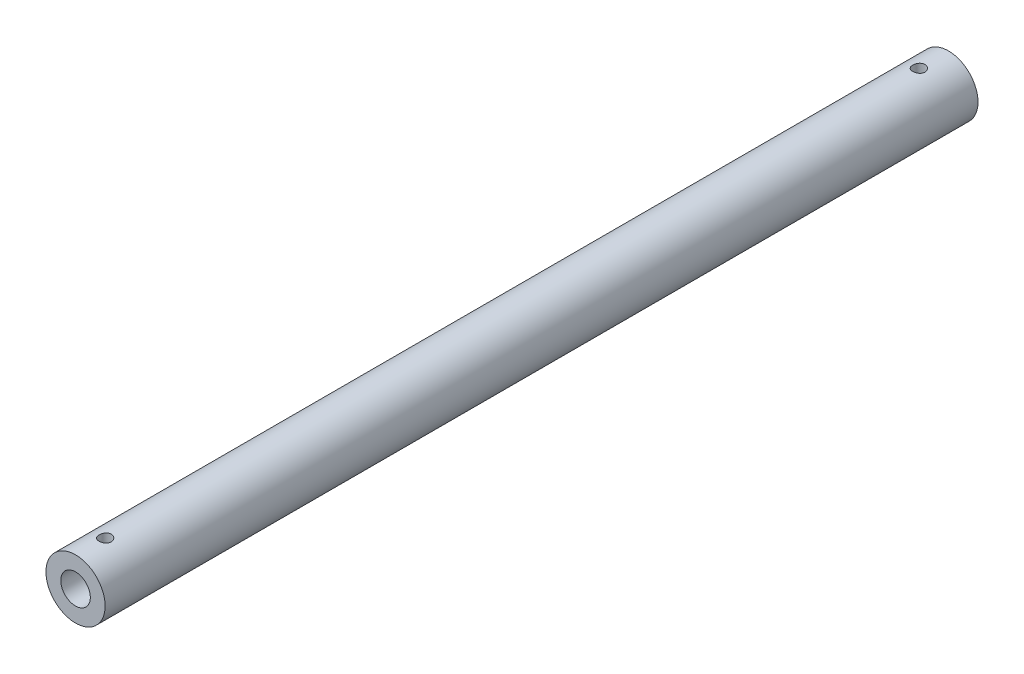
ISO-10303-21;
HEADER;
FILE_DESCRIPTION(('STEP AP214'),'2;1');
FILE_NAME('part.step','',(''),(''),'','','');
FILE_SCHEMA(('AUTOMOTIVE_DESIGN { 1 0 10303 214 1 1 1 1 }'));
ENDSEC;
DATA;
#1=APPLICATION_CONTEXT('core data for automotive mechanical design processes');
#2=APPLICATION_PROTOCOL_DEFINITION('international standard','automotive_design',2000,#1);
#3=PRODUCT_CONTEXT('',#1,'mechanical');
#4=PRODUCT('Part','Part','',(#3));
#5=PRODUCT_RELATED_PRODUCT_CATEGORY('part','',(#4));
#6=PRODUCT_DEFINITION_FORMATION('','',#4);
#7=PRODUCT_DEFINITION_CONTEXT('part definition',#1,'design');
#8=PRODUCT_DEFINITION('design','',#6,#7);
#9=PRODUCT_DEFINITION_SHAPE('','',#8);
#10=(LENGTH_UNIT() NAMED_UNIT(*) SI_UNIT(.MILLI.,.METRE.));
#11=(NAMED_UNIT(*) PLANE_ANGLE_UNIT() SI_UNIT($,.RADIAN.));
#12=(NAMED_UNIT(*) SI_UNIT($,.STERADIAN.) SOLID_ANGLE_UNIT());
#13=UNCERTAINTY_MEASURE_WITH_UNIT(LENGTH_MEASURE(1.E-05),#10,'distance_accuracy_value','');
#14=(GEOMETRIC_REPRESENTATION_CONTEXT(3) GLOBAL_UNCERTAINTY_ASSIGNED_CONTEXT((#13)) GLOBAL_UNIT_ASSIGNED_CONTEXT((#10,
#11,#12)) REPRESENTATION_CONTEXT('',''));
#15=CARTESIAN_POINT('',(0.,0.,0.));
#16=DIRECTION('',(0.,0.,1.));
#17=DIRECTION('',(1.,0.,0.));
#18=AXIS2_PLACEMENT_3D('',#15,#16,#17);
#19=CARTESIAN_POINT('',(0.,0.,-221.25));
#20=DIRECTION('',(0.,0.,1.));
#21=DIRECTION('',(1.,0.,0.));
#22=AXIS2_PLACEMENT_3D('',#19,#20,#21);
#23=CYLINDRICAL_SURFACE('',#22,15.);
#24=CARTESIAN_POINT('',(0.,15.,203.15));
#25=CARTESIAN_POINT('',(-0.172165692568075,14.9999968145247,203.15000618457));
#26=CARTESIAN_POINT('',(-0.344408344623985,14.997005579049,203.164390881014));
#27=CARTESIAN_POINT('',(-0.6840167687517,14.9853616038391,203.221499057615));
#28=CARTESIAN_POINT('',(-0.851378698493532,14.9767045230125,203.264244267549));
#29=CARTESIAN_POINT('',(-1.17626714760312,14.9546945810427,203.376689905818));
#30=CARTESIAN_POINT('',(-1.33380320695701,14.9413463608244,203.446363700585));
#31=CARTESIAN_POINT('',(-1.63494054093473,14.9114015957254,203.610607679373));
#32=CARTESIAN_POINT('',(-1.77854248092075,14.8948052060611,203.705176673833));
#33=CARTESIAN_POINT('',(-2.0498140026125,14.8599203077403,203.917970705814));
#34=CARTESIAN_POINT('',(-2.17725387792713,14.841612714398,204.03648547387));
#35=CARTESIAN_POINT('',(-2.41059374938868,14.8055061029318,204.293184305505));
#36=CARTESIAN_POINT('',(-2.51649198363873,14.7877071265103,204.431369976402));
#37=CARTESIAN_POINT('',(-2.70473262746811,14.7544460628154,204.725156332992));
#38=CARTESIAN_POINT('',(-2.78683486689837,14.7390084976833,204.880913928046));
#39=CARTESIAN_POINT('',(-2.92361365563604,14.7124902368737,205.204385744111));
#40=CARTESIAN_POINT('',(-2.97829310959917,14.7014090797868,205.372098696646));
#41=CARTESIAN_POINT('',(-3.05792378241659,14.6850518417562,205.712241853876));
#42=CARTESIAN_POINT('',(-3.08327931876006,14.6796968878264,205.884573532448));
#43=CARTESIAN_POINT('',(-3.1047987188951,14.6751611480918,206.231121638894));
#44=CARTESIAN_POINT('',(-3.10096577486346,14.6759796871273,206.405337858587));
#45=CARTESIAN_POINT('',(-3.06454338331474,14.6836268744082,206.747735233949));
#46=CARTESIAN_POINT('',(-3.03241955530402,14.6903582036209,206.915968419241));
#47=CARTESIAN_POINT('',(-2.94106317686199,14.7089190681247,207.244604990454));
#48=CARTESIAN_POINT('',(-2.88182925294598,14.7207488617187,207.405007979217));
#49=CARTESIAN_POINT('',(-2.73749545783407,14.7482719850807,207.714761349049));
#50=CARTESIAN_POINT('',(-2.65221295005861,14.7639924411575,207.864024117796));
#51=CARTESIAN_POINT('',(-2.45833155039526,14.7975084496401,208.146294231118));
#52=CARTESIAN_POINT('',(-2.34972980522963,14.8153042558583,208.279299583353));
#53=CARTESIAN_POINT('',(-2.10980951412047,14.8513860400371,208.527964018986));
#54=CARTESIAN_POINT('',(-1.97809406671112,14.8696748609556,208.643240085605));
#55=CARTESIAN_POINT('',(-1.69699917981561,14.9043690302707,208.850124474423));
#56=CARTESIAN_POINT('',(-1.54761948341342,14.920774351266,208.94173245232));
#57=CARTESIAN_POINT('',(-1.23499644988396,14.949897695655,209.098759280562));
#58=CARTESIAN_POINT('',(-1.07172936615429,14.9626092321176,209.164132133225));
#59=CARTESIAN_POINT('',(-0.736208050305234,14.9828639201261,209.266412723749));
#60=CARTESIAN_POINT('',(-0.56395498520553,14.9904077410196,209.30332414815));
#61=CARTESIAN_POINT('',(-0.21864065072356,14.9993830838028,209.347086713271));
#62=CARTESIAN_POINT('',(-0.0456484522187994,15.0009211054796,209.354461679909));
#63=CARTESIAN_POINT('',(0.299096179156922,14.9980082795858,209.340355851714));
#64=CARTESIAN_POINT('',(0.470848686046561,14.9935577925971,209.318876794247));
#65=CARTESIAN_POINT('',(0.806532778422362,14.9792348501822,209.248107567809));
#66=CARTESIAN_POINT('',(0.970523916752335,14.9694152228943,209.199088246188));
#67=CARTESIAN_POINT('',(1.28795822388415,14.9454516233604,209.074927550587));
#68=CARTESIAN_POINT('',(1.44140056223108,14.9313073111298,208.999784122801));
#69=CARTESIAN_POINT('',(1.73557589191958,14.899998810058,208.824389568514));
#70=CARTESIAN_POINT('',(1.87611842957524,14.8827978643853,208.723825711686));
#71=CARTESIAN_POINT('',(2.13852141882691,14.8473663952166,208.500861250337));
#72=CARTESIAN_POINT('',(2.26037971863336,14.8291357534649,208.378458134182));
#73=CARTESIAN_POINT('',(2.48399401838078,14.7933375094228,208.112898224027));
#74=CARTESIAN_POINT('',(2.58538928856011,14.7757855941988,207.969435189048));
#75=CARTESIAN_POINT('',(2.76264557446453,14.7436744809272,207.667206821806));
#76=CARTESIAN_POINT('',(2.83850764553233,14.729115159199,207.508442122345));
#77=CARTESIAN_POINT('',(2.96206237859332,14.704766460738,207.180938691601));
#78=CARTESIAN_POINT('',(3.00990595506134,14.6949515802098,207.012258882349));
#79=CARTESIAN_POINT('',(3.07651834817521,14.681151621117,206.669028213839));
#80=CARTESIAN_POINT('',(3.09529124863372,14.6771657237085,206.494478182742));
#81=CARTESIAN_POINT('',(3.10307030783304,14.6755226409731,206.148088801353));
#82=CARTESIAN_POINT('',(3.09264711298509,14.6777441283759,205.976262590665));
#83=CARTESIAN_POINT('',(3.04359493211144,14.6879932817592,205.636870134022));
#84=CARTESIAN_POINT('',(3.00496620761724,14.6960208939033,205.469303848583));
#85=CARTESIAN_POINT('',(2.90086151532538,14.716921819634,205.143582191028));
#86=CARTESIAN_POINT('',(2.83546006555444,14.7297816752769,204.985402081932));
#87=CARTESIAN_POINT('',(2.67973384395482,14.7589049039727,204.682172077593));
#88=CARTESIAN_POINT('',(2.58940680339969,14.7751685868093,204.537123379167));
#89=CARTESIAN_POINT('',(2.38446392361929,14.809635154064,204.261441834902));
#90=CARTESIAN_POINT('',(2.26943782754736,14.8278678241242,204.131117642797));
#91=CARTESIAN_POINT('',(2.01920377162768,14.8640090653401,203.89143294543));
#92=CARTESIAN_POINT('',(1.88399117387353,14.8819175609529,203.78207727097));
#93=CARTESIAN_POINT('',(1.59538198786284,14.9156320795551,203.586259613768));
#94=CARTESIAN_POINT('',(1.44179699181802,14.931412025711,203.500070618688));
#95=CARTESIAN_POINT('',(1.1220352287178,14.9588332815734,203.354863888172));
#96=CARTESIAN_POINT('',(0.955869690892328,14.9704782304995,203.295822246729));
#97=CARTESIAN_POINT('',(0.657833295489253,14.9861185683186,203.21770728621));
#98=CARTESIAN_POINT('',(0.527631279793751,14.9912930325766,203.192363403325));
#99=CARTESIAN_POINT('',(0.264967984387544,14.9982349131395,203.158507682225));
#100=CARTESIAN_POINT('',(0.132506785912507,15.0000024516911,203.149995240065));
#101=CARTESIAN_POINT('',(0.,15.,203.15));
#102=B_SPLINE_CURVE_WITH_KNOTS('',3,(#24,#25,#26,#27,#28,#29,#30,#31,#32,#33,#34,#35,#36,#37,
#38,#39,#40,#41,#42,#43,#44,#45,#46,#47,#48,#49,#50,#51,#52,#53,#54,#55,#56,#57,#58,#59,#60,#61,
#62,#63,#64,#65,#66,#67,#68,#69,#70,#71,#72,#73,#74,#75,#76,#77,#78,#79,#80,#81,#82,#83,#84,#85,
#86,#87,#88,#89,#90,#91,#92,#93,#94,#95,#96,#97,#98,#99,#100,#101),.UNSPECIFIED.,.T.,.F.,(4,2,2,
2,2,2,2,2,2,2,2,2,2,2,2,2,2,2,2,2,2,2,2,2,2,2,2,2,2,2,2,2,2,2,2,2,2,2,4),(0.,0.516012233354276,
1.03242029170924,1.54831890115687,2.06419286401491,2.58672901286762,3.10930788292938,
3.63699074660939,4.16461770564988,4.68487960325838,5.20508460362237,5.71688465009023,
6.22871062886655,6.74421096019477,7.25977440270464,7.78525818005795,8.31074960120177,
8.83715837566196,9.36349895418801,9.88046246952418,10.3973948586867,10.9093302438091,
11.4213058850333,11.9399157526589,12.4585853017375,12.9857239359749,13.5128407797481,
14.0370916901281,14.5612689477046,15.0752728884932,15.5892720633185,16.1018502189675,
16.6144750448609,17.1363837856733,17.6584126215689,18.1863470781733,18.7138157401919,
19.1109771901377,19.5081243889402),.UNSPECIFIED.);
#103=CARTESIAN_POINT('',(0.,15.,203.15));
#104=VERTEX_POINT('',#103);
#105=EDGE_CURVE('E74',#104,#104,#102,.T.);
#106=ORIENTED_EDGE('',*,*,#105,.F.);
#107=EDGE_LOOP('',(#106));
#108=FACE_BOUND('',#107,.T.);
#109=CARTESIAN_POINT('',(0.,0.,-221.25));
#110=DIRECTION('',(0.,0.,1.));
#111=DIRECTION('',(1.,0.,0.));
#112=AXIS2_PLACEMENT_3D('',#109,#110,#111);
#113=CIRCLE('',#112,15.);
#114=CARTESIAN_POINT('',(15.,0.,-221.25));
#115=VERTEX_POINT('',#114);
#116=EDGE_CURVE('E10',#115,#115,#113,.T.);
#117=ORIENTED_EDGE('',*,*,#116,.T.);
#118=EDGE_LOOP('',(#117));
#119=FACE_BOUND('',#118,.T.);
#120=CARTESIAN_POINT('',(0.,0.,221.25));
#121=DIRECTION('',(0.,0.,1.));
#122=DIRECTION('',(1.,0.,0.));
#123=AXIS2_PLACEMENT_3D('',#120,#121,#122);
#124=CIRCLE('',#123,15.);
#125=CARTESIAN_POINT('',(15.,0.,221.25));
#126=VERTEX_POINT('',#125);
#127=EDGE_CURVE('E63',#126,#126,#124,.T.);
#128=ORIENTED_EDGE('',*,*,#127,.F.);
#129=EDGE_LOOP('',(#128));
#130=FACE_BOUND('',#129,.T.);
#131=CARTESIAN_POINT('',(0.,15.,-209.35));
#132=CARTESIAN_POINT('',(0.172165692568075,14.9999968145247,-209.34999381543));
#133=CARTESIAN_POINT('',(0.344408344623985,14.997005579049,-209.335609118986));
#134=CARTESIAN_POINT('',(0.6840167687517,14.9853616038391,-209.278500942385));
#135=CARTESIAN_POINT('',(0.851378698493531,14.9767045230125,-209.235755732451));
#136=CARTESIAN_POINT('',(1.17626714760312,14.9546945810427,-209.123310094182));
#137=CARTESIAN_POINT('',(1.33380320695702,14.9413463608244,-209.053636299415));
#138=CARTESIAN_POINT('',(1.63494054093474,14.9114015957254,-208.889392320627));
#139=CARTESIAN_POINT('',(1.77854248092075,14.8948052060611,-208.794823326167));
#140=CARTESIAN_POINT('',(2.0498140026125,14.8599203077403,-208.582029294186));
#141=CARTESIAN_POINT('',(2.17725387792713,14.841612714398,-208.46351452613));
#142=CARTESIAN_POINT('',(2.41059374938868,14.8055061029318,-208.206815694495));
#143=CARTESIAN_POINT('',(2.51649198363873,14.7877071265103,-208.068630023598));
#144=CARTESIAN_POINT('',(2.70473262746811,14.7544460628154,-207.774843667008));
#145=CARTESIAN_POINT('',(2.78683486689837,14.7390084976833,-207.619086071954));
#146=CARTESIAN_POINT('',(2.92361365563604,14.7124902368737,-207.295614255888));
#147=CARTESIAN_POINT('',(2.97829310959917,14.7014090797868,-207.127901303354));
#148=CARTESIAN_POINT('',(3.05792378241659,14.6850518417562,-206.787758146124));
#149=CARTESIAN_POINT('',(3.08327931876006,14.6796968878264,-206.615426467552));
#150=CARTESIAN_POINT('',(3.1047987188951,14.6751611480918,-206.268878361106));
#151=CARTESIAN_POINT('',(3.10096577486346,14.6759796871273,-206.094662141413));
#152=CARTESIAN_POINT('',(3.06454338331474,14.6836268744082,-205.752264766051));
#153=CARTESIAN_POINT('',(3.03241955530402,14.6903582036209,-205.584031580759));
#154=CARTESIAN_POINT('',(2.94106317686199,14.7089190681247,-205.255395009546));
#155=CARTESIAN_POINT('',(2.88182925294598,14.7207488617187,-205.094992020783));
#156=CARTESIAN_POINT('',(2.73749545783407,14.7482719850807,-204.785238650951));
#157=CARTESIAN_POINT('',(2.65221295005861,14.7639924411575,-204.635975882204));
#158=CARTESIAN_POINT('',(2.45833155039526,14.7975084496401,-204.353705768882));
#159=CARTESIAN_POINT('',(2.34972980522963,14.8153042558583,-204.220700416647));
#160=CARTESIAN_POINT('',(2.10980951412047,14.8513860400371,-203.972035981014));
#161=CARTESIAN_POINT('',(1.97809406671112,14.8696748609556,-203.856759914395));
#162=CARTESIAN_POINT('',(1.69699917981561,14.9043690302707,-203.649875525577));
#163=CARTESIAN_POINT('',(1.54761948341342,14.920774351266,-203.55826754768));
#164=CARTESIAN_POINT('',(1.23499644988397,14.949897695655,-203.401240719438));
#165=CARTESIAN_POINT('',(1.0717293661543,14.9626092321176,-203.335867866775));
#166=CARTESIAN_POINT('',(0.736208050305236,14.9828639201261,-203.233587276251));
#167=CARTESIAN_POINT('',(0.563954985205533,14.9904077410196,-203.19667585185));
#168=CARTESIAN_POINT('',(0.218640650723562,14.9993830838028,-203.152913286729));
#169=CARTESIAN_POINT('',(0.0456484522187996,15.0009211054796,-203.145538320091));
#170=CARTESIAN_POINT('',(-0.299096179156922,14.9980082795858,-203.159644148286));
#171=CARTESIAN_POINT('',(-0.470848686046561,14.9935577925971,-203.181123205753));
#172=CARTESIAN_POINT('',(-0.806532778422365,14.9792348501822,-203.25189243219));
#173=CARTESIAN_POINT('',(-0.970523916752342,14.9694152228943,-203.300911753812));
#174=CARTESIAN_POINT('',(-1.28795822388416,14.9454516233604,-203.425072449413));
#175=CARTESIAN_POINT('',(-1.44140056223108,14.9313073111298,-203.500215877199));
#176=CARTESIAN_POINT('',(-1.73557589191957,14.899998810058,-203.675610431486));
#177=CARTESIAN_POINT('',(-1.87611842957523,14.8827978643853,-203.776174288314));
#178=CARTESIAN_POINT('',(-2.13852141882691,14.8473663952166,-203.999138749663));
#179=CARTESIAN_POINT('',(-2.26037971863335,14.8291357534649,-204.121541865818));
#180=CARTESIAN_POINT('',(-2.48399401838079,14.7933375094228,-204.387101775973));
#181=CARTESIAN_POINT('',(-2.58538928856014,14.7757855941988,-204.530564810952));
#182=CARTESIAN_POINT('',(-2.76264557446455,14.7436744809272,-204.832793178194));
#183=CARTESIAN_POINT('',(-2.83850764553234,14.7291151591989,-204.991557877655));
#184=CARTESIAN_POINT('',(-2.96206237859332,14.704766460738,-205.319061308399));
#185=CARTESIAN_POINT('',(-3.00990595506134,14.6949515802098,-205.48774111765));
#186=CARTESIAN_POINT('',(-3.07651834817521,14.681151621117,-205.830971786161));
#187=CARTESIAN_POINT('',(-3.09529124863372,14.6771657237085,-206.005521817258));
#188=CARTESIAN_POINT('',(-3.10307030783304,14.6755226409731,-206.351911198647));
#189=CARTESIAN_POINT('',(-3.09264711298509,14.6777441283759,-206.523737409335));
#190=CARTESIAN_POINT('',(-3.04359493211143,14.6879932817592,-206.863129865978));
#191=CARTESIAN_POINT('',(-3.00496620761724,14.6960208939033,-207.030696151417));
#192=CARTESIAN_POINT('',(-2.90086151532538,14.716921819634,-207.356417808972));
#193=CARTESIAN_POINT('',(-2.83546006555444,14.7297816752769,-207.514597918068));
#194=CARTESIAN_POINT('',(-2.67973384395482,14.7589049039727,-207.817827922407));
#195=CARTESIAN_POINT('',(-2.58940680339969,14.7751685868093,-207.962876620833));
#196=CARTESIAN_POINT('',(-2.38446392361929,14.809635154064,-208.238558165098));
#197=CARTESIAN_POINT('',(-2.26943782754736,14.8278678241242,-208.368882357203));
#198=CARTESIAN_POINT('',(-2.01920377162768,14.8640090653401,-208.60856705457));
#199=CARTESIAN_POINT('',(-1.88399117387353,14.8819175609529,-208.71792272903));
#200=CARTESIAN_POINT('',(-1.59538198786284,14.9156320795551,-208.913740386232));
#201=CARTESIAN_POINT('',(-1.44179699181802,14.931412025711,-208.999929381312));
#202=CARTESIAN_POINT('',(-1.1220352287178,14.9588332815734,-209.145136111828));
#203=CARTESIAN_POINT('',(-0.955869690892328,14.9704782304995,-209.204177753271));
#204=CARTESIAN_POINT('',(-0.657833295489253,14.9861185683186,-209.28229271379));
#205=CARTESIAN_POINT('',(-0.527631279793751,14.9912930325766,-209.307636596675));
#206=CARTESIAN_POINT('',(-0.264967984387544,14.9982349131395,-209.341492317775));
#207=CARTESIAN_POINT('',(-0.132506785912507,15.0000024516911,-209.350004759935));
#208=CARTESIAN_POINT('',(0.,15.,-209.35));
#209=B_SPLINE_CURVE_WITH_KNOTS('',3,(#131,#132,#133,#134,#135,#136,#137,#138,#139,#140,#141,
#142,#143,#144,#145,#146,#147,#148,#149,#150,#151,#152,#153,#154,#155,#156,#157,#158,#159,#160,
#161,#162,#163,#164,#165,#166,#167,#168,#169,#170,#171,#172,#173,#174,#175,#176,#177,#178,#179,
#180,#181,#182,#183,#184,#185,#186,#187,#188,#189,#190,#191,#192,#193,#194,#195,#196,#197,#198,
#199,#200,#201,#202,#203,#204,#205,#206,#207,#208),.UNSPECIFIED.,.T.,.F.,(4,2,2,2,2,2,2,2,2,2,2,
2,2,2,2,2,2,2,2,2,2,2,2,2,2,2,2,2,2,2,2,2,2,2,2,2,2,2,4),(0.,0.516012233354276,1.03242029170924,
1.54831890115688,2.06419286401491,2.58672901286762,3.10930788292938,3.63699074660939,
4.16461770564988,4.68487960325835,5.20508460362237,5.71688465009023,6.22871062886655,
6.74421096019477,7.25977440270464,7.78525818005795,8.31074960120177,8.83715837566194,
9.36349895418801,9.88046246952418,10.3973948586867,10.9093302438091,11.4213058850333,
11.9399157526589,12.4585853017375,12.9857239359749,13.5128407797481,14.0370916901281,
14.5612689477046,15.0752728884932,15.5892720633185,16.1018502189675,16.6144750448609,
17.1363837856733,17.6584126215689,18.1863470781733,18.7138157401919,19.1109771901377,
19.5081243889402),.UNSPECIFIED.);
#210=CARTESIAN_POINT('',(0.,15.,-209.35));
#211=VERTEX_POINT('',#210);
#212=EDGE_CURVE('E73',#211,#211,#209,.T.);
#213=ORIENTED_EDGE('',*,*,#212,.T.);
#214=EDGE_LOOP('',(#213));
#215=FACE_BOUND('',#214,.T.);
#216=ADVANCED_FACE('F43',(#108,#119,#130,#215),#23,.T.);
#217=CARTESIAN_POINT('',(0.,0.,-221.25));
#218=DIRECTION('',(0.,0.,1.));
#219=DIRECTION('',(1.,0.,0.));
#220=AXIS2_PLACEMENT_3D('',#217,#218,#219);
#221=CYLINDRICAL_SURFACE('',#220,7.5);
#222=CARTESIAN_POINT('',(0.,7.5,203.15));
#223=CARTESIAN_POINT('',(-0.166153002613096,7.49999499657015,203.150006439139));
#224=CARTESIAN_POINT('',(-0.332600464403828,7.49441556709234,203.163437102607));
#225=CARTESIAN_POINT('',(-0.660768761003523,7.47265556326767,203.216659456979));
#226=CARTESIAN_POINT('',(-0.822475981409231,7.4564470859861,203.25652053498));
#227=CARTESIAN_POINT('',(-1.13589928883872,7.41516232897275,203.360897830234));
#228=CARTESIAN_POINT('',(-1.28764700409263,7.39011591076245,203.425331081826));
#229=CARTESIAN_POINT('',(-1.57803340286612,7.33360222650622,203.57668057778));
#230=CARTESIAN_POINT('',(-1.71667615552021,7.30213696318032,203.663589811752));
#231=CARTESIAN_POINT('',(-1.98400959910197,7.23419554679821,203.86197764626));
#232=CARTESIAN_POINT('',(-2.11196525773685,7.19755699911941,203.974390668417));
#233=CARTESIAN_POINT('',(-2.34783768718456,7.12411042208018,204.218619929221));
#234=CARTESIAN_POINT('',(-2.45574406182104,7.0873023148786,204.350446171071));
#235=CARTESIAN_POINT('',(-2.6535947314415,7.01570032840253,204.637471400951));
#236=CARTESIAN_POINT('',(-2.74242148647984,6.98108925988135,204.793491095404));
#237=CARTESIAN_POINT('',(-2.89224243961144,6.9203697427042,205.119896741966));
#238=CARTESIAN_POINT('',(-2.9532507497489,6.89425698486144,205.290275357834));
#239=CARTESIAN_POINT('',(-3.04268024888774,6.8552453498953,205.632104091265));
#240=CARTESIAN_POINT('',(-3.07251470951095,6.84177651513845,205.803116939132));
#241=CARTESIAN_POINT('',(-3.10316007729673,6.82793602371857,206.148211058538));
#242=CARTESIAN_POINT('',(-3.10398662811009,6.82755730769831,206.322290625546));
#243=CARTESIAN_POINT('',(-3.07765851268915,6.83945669009682,206.654603117149));
#244=CARTESIAN_POINT('',(-3.05260360053316,6.85078502883839,206.813043193012));
#245=CARTESIAN_POINT('',(-2.97874158057689,6.88321931438638,207.123228128714));
#246=CARTESIAN_POINT('',(-2.92993000846889,6.90432709889237,207.274971724314));
#247=CARTESIAN_POINT('',(-2.80899254802325,6.95441629953129,207.57125495533));
#248=CARTESIAN_POINT('',(-2.73639615555451,6.98355455159123,207.715574835102));
#249=CARTESIAN_POINT('',(-2.57028194875633,7.04638370508448,207.990539248003));
#250=CARTESIAN_POINT('',(-2.47675595937095,7.0800763834253,208.121178408124));
#251=CARTESIAN_POINT('',(-2.26231791362187,7.15162260147758,208.37649017387));
#252=CARTESIAN_POINT('',(-2.13977666022387,7.18958932893573,208.499766523274));
#253=CARTESIAN_POINT('',(-1.87537753928262,7.26304146095989,208.72448333847));
#254=CARTESIAN_POINT('',(-1.73351530071414,7.29852630128624,208.825918849724));
#255=CARTESIAN_POINT('',(-1.43031567972321,7.3640172601883,209.006077758159));
#256=CARTESIAN_POINT('',(-1.2686134301535,7.3938829557076,209.084241913309));
#257=CARTESIAN_POINT('',(-0.932805541489826,7.44369617955768,209.211770039552));
#258=CARTESIAN_POINT('',(-0.758706702716548,7.46364909848067,209.261149666282));
#259=CARTESIAN_POINT('',(-0.414723271042768,7.49038660533013,209.326804702462));
#260=CARTESIAN_POINT('',(-0.245254188339049,7.49791555875999,209.344954434622));
#261=CARTESIAN_POINT('',(0.0944609767199231,7.50132646954416,209.353211537545));
#262=CARTESIAN_POINT('',(0.26470682703357,7.4972117034244,209.343326797167));
#263=CARTESIAN_POINT('',(0.592423142194307,7.4782813005357,209.297145000089));
#264=CARTESIAN_POINT('',(0.750112133817265,7.46399615818736,209.262156687961));
#265=CARTESIAN_POINT('',(1.05721523253206,7.42672470407196,209.168574109654));
#266=CARTESIAN_POINT('',(1.20662828750662,7.40373728888471,209.109976849877));
#267=CARTESIAN_POINT('',(1.49816127489848,7.35038535240201,208.968924328521));
#268=CARTESIAN_POINT('',(1.63991168325742,7.31981428517996,208.885785962502));
#269=CARTESIAN_POINT('',(1.90795528937434,7.25456871961595,208.698763178137));
#270=CARTESIAN_POINT('',(2.03424204531875,7.21989252291917,208.594870160969));
#271=CARTESIAN_POINT('',(2.27711097618432,7.14716389966532,208.36072920737));
#272=CARTESIAN_POINT('',(2.39238480652959,7.10904560593693,208.229141117405));
#273=CARTESIAN_POINT('',(2.59957048468988,7.03593167919986,207.947866140141));
#274=CARTESIAN_POINT('',(2.69147733770028,7.00093671485367,207.798175393385));
#275=CARTESIAN_POINT('',(2.85022442048547,6.93784170380674,207.482030802691));
#276=CARTESIAN_POINT('',(2.91671570889454,6.90983935005117,207.315380814679));
#277=CARTESIAN_POINT('',(3.02013779062217,6.86527482101638,206.971731553331));
#278=CARTESIAN_POINT('',(3.05709243461338,6.84870341679441,206.794740754336));
#279=CARTESIAN_POINT('',(3.09804010789086,6.83027124265743,206.449926426674));
#280=CARTESIAN_POINT('',(3.10432447712996,6.82738831148697,206.282428294473));
#281=CARTESIAN_POINT('',(3.08985007296315,6.8339513608338,205.948868064823));
#282=CARTESIAN_POINT('',(3.06909529490485,6.84339551988095,205.782805758864));
#283=CARTESIAN_POINT('',(3.00304618929306,6.87262082828987,205.464536568116));
#284=CARTESIAN_POINT('',(2.9589003999752,6.89191674393384,205.312042558786));
#285=CARTESIAN_POINT('',(2.84843476313013,6.93829866651058,205.016584992252));
#286=CARTESIAN_POINT('',(2.78210870560485,6.96538685481484,204.873624117579));
#287=CARTESIAN_POINT('',(2.62461324834434,7.0263027906572,204.591998592494));
#288=CARTESIAN_POINT('',(2.53219913435248,7.06043592217453,204.454097378428));
#289=CARTESIAN_POINT('',(2.32690149913443,7.13072826622725,204.19504024527));
#290=CARTESIAN_POINT('',(2.21401106371445,7.16688816027646,204.073890006869));
#291=CARTESIAN_POINT('',(1.96144980129081,7.24024921308954,203.842916152182));
#292=CARTESIAN_POINT('',(1.82044465095394,7.27734125674949,203.734512756864));
#293=CARTESIAN_POINT('',(1.52076323380497,7.34580237908539,203.542812658807));
#294=CARTESIAN_POINT('',(1.3620789361027,7.37716883966076,203.459527430395));
#295=CARTESIAN_POINT('',(1.11564028430046,7.4170196735755,203.356361942525));
#296=CARTESIAN_POINT('',(1.03279444562306,7.42903456588251,203.325762581434));
#297=CARTESIAN_POINT('',(0.864502653411425,7.45049041775362,203.271673252691));
#298=CARTESIAN_POINT('',(0.779057950570129,7.45993259430366,203.248179923053));
#299=CARTESIAN_POINT('',(0.60643903053414,7.4759436159557,203.20860916377));
#300=CARTESIAN_POINT('',(0.51926966743142,7.48251958049345,203.192513353808));
#301=CARTESIAN_POINT('',(0.343742028836119,7.49263353478285,203.167844081351));
#302=CARTESIAN_POINT('',(0.255384680685455,7.49617376860472,203.159265062197));
#303=CARTESIAN_POINT('',(0.139047150358915,7.49876251103851,203.152994945568));
#304=CARTESIAN_POINT('',(0.111252100871382,7.4992261831606,203.151872324235));
#305=CARTESIAN_POINT('',(0.0556407868836736,7.4998453469052,203.150374311519));
#306=CARTESIAN_POINT('',(0.0278245223397624,7.50000083789064,203.149998921681));
#307=CARTESIAN_POINT('',(0.,7.5,203.15));
#308=B_SPLINE_CURVE_WITH_KNOTS('',3,(#222,#223,#224,#225,#226,#227,#228,#229,#230,#231,#232,
#233,#234,#235,#236,#237,#238,#239,#240,#241,#242,#243,#244,#245,#246,#247,#248,#249,#250,#251,
#252,#253,#254,#255,#256,#257,#258,#259,#260,#261,#262,#263,#264,#265,#266,#267,#268,#269,#270,
#271,#272,#273,#274,#275,#276,#277,#278,#279,#280,#281,#282,#283,#284,#285,#286,#287,#288,#289,
#290,#291,#292,#293,#294,#295,#296,#297,#298,#299,#300,#301,#302,#303,#304,#305,#306,#307),
.UNSPECIFIED.,.T.,.F.,(4,2,2,2,2,2,2,2,2,2,2,2,2,2,2,2,2,2,2,2,2,2,2,2,2,2,2,2,2,2,2,2,2,2,2,2,
2,2,2,2,2,2,4),(0.,0.498350072093011,0.998013657585997,1.49600490175053,1.99384100650711,
2.51422237468694,3.03487282828192,3.58063836896801,4.12612673889392,4.6456426340429,
5.1648783556028,5.64506306376062,6.12533804220394,6.61575367999805,7.10636120848081,
7.63770794739148,8.16917509423632,8.71253919590832,9.25560749053009,9.76477034291971,
10.2737899318644,10.758038466616,11.2423484231004,11.7416676385666,12.2411941567272,
12.7758736132641,13.310667264219,13.8525600209146,14.3940147589522,14.8943247334461,
15.394560789723,15.8722439818826,16.3500610271901,16.8563461469572,17.3628025422318,
17.9053115722873,18.448068053912,18.7151630289678,18.9821314383947,19.2484328877127,
19.5145373117832,19.5979924635494,19.6814477878343),.UNSPECIFIED.);
#309=CARTESIAN_POINT('',(0.,7.5,203.15));
#310=VERTEX_POINT('',#309);
#311=EDGE_CURVE('E47',#310,#310,#308,.T.);
#312=ORIENTED_EDGE('',*,*,#311,.T.);
#313=EDGE_LOOP('',(#312));
#314=FACE_BOUND('',#313,.T.);
#315=CARTESIAN_POINT('',(0.,0.,-221.25));
#316=DIRECTION('',(0.,0.,1.));
#317=DIRECTION('',(1.,0.,0.));
#318=AXIS2_PLACEMENT_3D('',#315,#316,#317);
#319=CIRCLE('',#318,7.5);
#320=CARTESIAN_POINT('',(7.5,0.,-221.25));
#321=VERTEX_POINT('',#320);
#322=EDGE_CURVE('E57',#321,#321,#319,.T.);
#323=ORIENTED_EDGE('',*,*,#322,.F.);
#324=EDGE_LOOP('',(#323));
#325=FACE_BOUND('',#324,.T.);
#326=CARTESIAN_POINT('',(0.,0.,221.25));
#327=DIRECTION('',(0.,0.,1.));
#328=DIRECTION('',(1.,0.,0.));
#329=AXIS2_PLACEMENT_3D('',#326,#327,#328);
#330=CIRCLE('',#329,7.5);
#331=CARTESIAN_POINT('',(7.5,0.,221.25));
#332=VERTEX_POINT('',#331);
#333=EDGE_CURVE('E94',#332,#332,#330,.T.);
#334=ORIENTED_EDGE('',*,*,#333,.T.);
#335=EDGE_LOOP('',(#334));
#336=FACE_BOUND('',#335,.T.);
#337=CARTESIAN_POINT('',(0.,7.5,-209.35));
#338=CARTESIAN_POINT('',(0.166153002613096,7.49999499657015,-209.349993560861));
#339=CARTESIAN_POINT('',(0.332600464403828,7.49441556709234,-209.336562897393));
#340=CARTESIAN_POINT('',(0.660768761003523,7.47265556326767,-209.283340543021));
#341=CARTESIAN_POINT('',(0.822475981409231,7.4564470859861,-209.24347946502));
#342=CARTESIAN_POINT('',(1.13589928883872,7.41516232897275,-209.139102169766));
#343=CARTESIAN_POINT('',(1.28764700409263,7.39011591076245,-209.074668918174));
#344=CARTESIAN_POINT('',(1.57803340286612,7.33360222650622,-208.92331942222));
#345=CARTESIAN_POINT('',(1.71667615552021,7.30213696318032,-208.836410188248));
#346=CARTESIAN_POINT('',(1.98400959910197,7.23419554679821,-208.63802235374));
#347=CARTESIAN_POINT('',(2.11196525773685,7.19755699911941,-208.525609331583));
#348=CARTESIAN_POINT('',(2.34783768718456,7.12411042208018,-208.281380070779));
#349=CARTESIAN_POINT('',(2.45574406182104,7.0873023148786,-208.149553828929));
#350=CARTESIAN_POINT('',(2.6535947314415,7.01570032840253,-207.862528599049));
#351=CARTESIAN_POINT('',(2.74242148647984,6.98108925988135,-207.706508904596));
#352=CARTESIAN_POINT('',(2.89224243961144,6.9203697427042,-207.380103258034));
#353=CARTESIAN_POINT('',(2.9532507497489,6.89425698486144,-207.209724642166));
#354=CARTESIAN_POINT('',(3.04268024888774,6.8552453498953,-206.867895908735));
#355=CARTESIAN_POINT('',(3.07251470951095,6.84177651513845,-206.696883060868));
#356=CARTESIAN_POINT('',(3.10316007729673,6.82793602371857,-206.351788941462));
#357=CARTESIAN_POINT('',(3.10398662811009,6.82755730769831,-206.177709374454));
#358=CARTESIAN_POINT('',(3.07765851268915,6.83945669009682,-205.845396882851));
#359=CARTESIAN_POINT('',(3.05260360053316,6.85078502883839,-205.686956806988));
#360=CARTESIAN_POINT('',(2.97874158057689,6.88321931438638,-205.376771871286));
#361=CARTESIAN_POINT('',(2.92993000846889,6.90432709889237,-205.225028275686));
#362=CARTESIAN_POINT('',(2.80899254802325,6.95441629953129,-204.92874504467));
#363=CARTESIAN_POINT('',(2.73639615555451,6.98355455159123,-204.784425164898));
#364=CARTESIAN_POINT('',(2.57028194875633,7.04638370508448,-204.509460751997));
#365=CARTESIAN_POINT('',(2.47675595937095,7.0800763834253,-204.378821591876));
#366=CARTESIAN_POINT('',(2.26231791362188,7.15162260147758,-204.12350982613));
#367=CARTESIAN_POINT('',(2.1397766602239,7.18958932893572,-204.000233476726));
#368=CARTESIAN_POINT('',(1.87537753928266,7.26304146095989,-203.77551666153));
#369=CARTESIAN_POINT('',(1.73351530071416,7.29852630128623,-203.674081150276));
#370=CARTESIAN_POINT('',(1.43031567972321,7.3640172601883,-203.493922241841));
#371=CARTESIAN_POINT('',(1.2686134301535,7.3938829557076,-203.415758086691));
#372=CARTESIAN_POINT('',(0.932805541489826,7.44369617955768,-203.288229960448));
#373=CARTESIAN_POINT('',(0.758706702716548,7.46364909848067,-203.238850333718));
#374=CARTESIAN_POINT('',(0.414723271042769,7.49038660533013,-203.173195297538));
#375=CARTESIAN_POINT('',(0.245254188339049,7.49791555875999,-203.155045565378));
#376=CARTESIAN_POINT('',(-0.0944609767199226,7.50132646954416,-203.146788462455));
#377=CARTESIAN_POINT('',(-0.26470682703357,7.4972117034244,-203.156673202833));
#378=CARTESIAN_POINT('',(-0.592423142194307,7.4782813005357,-203.202854999911));
#379=CARTESIAN_POINT('',(-0.750112133817265,7.46399615818736,-203.237843312039));
#380=CARTESIAN_POINT('',(-1.05721523253206,7.42672470407196,-203.331425890346));
#381=CARTESIAN_POINT('',(-1.20662828750662,7.40373728888471,-203.390023150123));
#382=CARTESIAN_POINT('',(-1.49816127489848,7.35038535240201,-203.531075671479));
#383=CARTESIAN_POINT('',(-1.63991168325742,7.31981428517996,-203.614214037498));
#384=CARTESIAN_POINT('',(-1.90795528937434,7.25456871961595,-203.801236821863));
#385=CARTESIAN_POINT('',(-2.03424204531875,7.21989252291917,-203.905129839031));
#386=CARTESIAN_POINT('',(-2.27711097618432,7.14716389966532,-204.13927079263));
#387=CARTESIAN_POINT('',(-2.39238480652959,7.10904560593693,-204.270858882595));
#388=CARTESIAN_POINT('',(-2.59957048468988,7.03593167919986,-204.552133859859));
#389=CARTESIAN_POINT('',(-2.69147733770028,7.00093671485367,-204.701824606615));
#390=CARTESIAN_POINT('',(-2.85022442048548,6.93784170380673,-205.017969197309));
#391=CARTESIAN_POINT('',(-2.91671570889455,6.90983935005117,-205.184619185321));
#392=CARTESIAN_POINT('',(-3.02013779062217,6.86527482101638,-205.528268446669));
#393=CARTESIAN_POINT('',(-3.05709243461338,6.84870341679441,-205.705259245664));
#394=CARTESIAN_POINT('',(-3.09804010789086,6.83027124265743,-206.050073573326));
#395=CARTESIAN_POINT('',(-3.10432447712996,6.82738831148697,-206.217571705527));
#396=CARTESIAN_POINT('',(-3.08985007296315,6.8339513608338,-206.551131935177));
#397=CARTESIAN_POINT('',(-3.06909529490485,6.84339551988095,-206.717194241136));
#398=CARTESIAN_POINT('',(-3.00304618929306,6.87262082828987,-207.035463431884));
#399=CARTESIAN_POINT('',(-2.9589003999752,6.89191674393384,-207.187957441214));
#400=CARTESIAN_POINT('',(-2.84843476313013,6.93829866651058,-207.483415007748));
#401=CARTESIAN_POINT('',(-2.78210870560485,6.96538685481484,-207.626375882421));
#402=CARTESIAN_POINT('',(-2.62461324834435,7.0263027906572,-207.908001407506));
#403=CARTESIAN_POINT('',(-2.53219913435249,7.06043592217452,-208.045902621572));
#404=CARTESIAN_POINT('',(-2.32690149913444,7.13072826622725,-208.30495975473));
#405=CARTESIAN_POINT('',(-2.21401106371446,7.16688816027646,-208.426109993131));
#406=CARTESIAN_POINT('',(-1.96144980129081,7.24024921308954,-208.657083847818));
#407=CARTESIAN_POINT('',(-1.82044465095394,7.2773412567495,-208.765487243136));
#408=CARTESIAN_POINT('',(-1.52076323380496,7.34580237908539,-208.957187341193));
#409=CARTESIAN_POINT('',(-1.36207893610269,7.37716883966076,-209.040472569605));
#410=CARTESIAN_POINT('',(-1.11564028430046,7.41701967357549,-209.143638057475));
#411=CARTESIAN_POINT('',(-1.03279444562306,7.42903456588251,-209.174237418566));
#412=CARTESIAN_POINT('',(-0.864502653411425,7.45049041775362,-209.228326747309));
#413=CARTESIAN_POINT('',(-0.779057950570129,7.45993259430366,-209.251820076947));
#414=CARTESIAN_POINT('',(-0.606439030534141,7.4759436159557,-209.29139083623));
#415=CARTESIAN_POINT('',(-0.519269667431423,7.48251958049345,-209.307486646192));
#416=CARTESIAN_POINT('',(-0.343742028836121,7.49263353478285,-209.332155918649));
#417=CARTESIAN_POINT('',(-0.255384680685456,7.49617376860472,-209.340734937803));
#418=CARTESIAN_POINT('',(-0.139047150358915,7.49876251103851,-209.347005054432));
#419=CARTESIAN_POINT('',(-0.111252100871381,7.4992261831606,-209.348127675765));
#420=CARTESIAN_POINT('',(-0.0556407868836726,7.4998453469052,-209.349625688481));
#421=CARTESIAN_POINT('',(-0.0278245223397619,7.50000083789064,-209.350001078319));
#422=CARTESIAN_POINT('',(0.,7.5,-209.35));
#423=B_SPLINE_CURVE_WITH_KNOTS('',3,(#337,#338,#339,#340,#341,#342,#343,#344,#345,#346,#347,
#348,#349,#350,#351,#352,#353,#354,#355,#356,#357,#358,#359,#360,#361,#362,#363,#364,#365,#366,
#367,#368,#369,#370,#371,#372,#373,#374,#375,#376,#377,#378,#379,#380,#381,#382,#383,#384,#385,
#386,#387,#388,#389,#390,#391,#392,#393,#394,#395,#396,#397,#398,#399,#400,#401,#402,#403,#404,
#405,#406,#407,#408,#409,#410,#411,#412,#413,#414,#415,#416,#417,#418,#419,#420,#421,#422),
.UNSPECIFIED.,.T.,.F.,(4,2,2,2,2,2,2,2,2,2,2,2,2,2,2,2,2,2,2,2,2,2,2,2,2,2,2,2,2,2,2,2,2,2,2,2,
2,2,2,2,2,2,4),(0.,0.498350072093011,0.998013657585997,1.49600490175053,1.99384100650711,
2.51422237468694,3.03487282828192,3.58063836896801,4.12612673889392,4.6456426340429,
5.1648783556028,5.64506306376062,6.12533804220394,6.61575367999805,7.10636120848081,
7.6377079473914,8.16917509423632,8.71253919590832,9.25560749053009,9.76477034291971,
10.2737899318644,10.758038466616,11.2423484231004,11.7416676385666,12.2411941567272,
12.7758736132641,13.310667264219,13.8525600209146,14.3940147589522,14.8943247334461,
15.394560789723,15.8722439818826,16.3500610271901,16.8563461469572,17.3628025422318,
17.9053115722873,18.448068053912,18.7151630289678,18.9821314383947,19.2484328877127,
19.5145373117832,19.5979924635494,19.6814477878343),.UNSPECIFIED.);
#424=CARTESIAN_POINT('',(0.,7.5,-209.35));
#425=VERTEX_POINT('',#424);
#426=EDGE_CURVE('E66',#425,#425,#423,.T.);
#427=ORIENTED_EDGE('',*,*,#426,.F.);
#428=EDGE_LOOP('',(#427));
#429=FACE_BOUND('',#428,.T.);
#430=ADVANCED_FACE('F75',(#314,#325,#336,#429),#221,.F.);
#431=CARTESIAN_POINT('',(0.,0.,-221.25));
#432=DIRECTION('',(0.,0.,1.));
#433=DIRECTION('',(1.,0.,0.));
#434=AXIS2_PLACEMENT_3D('',#431,#432,#433);
#435=PLANE('',#434);
#436=ORIENTED_EDGE('',*,*,#322,.T.);
#437=EDGE_LOOP('',(#436));
#438=FACE_BOUND('',#437,.T.);
#439=ORIENTED_EDGE('',*,*,#116,.F.);
#440=EDGE_LOOP('',(#439));
#441=FACE_BOUND('',#440,.T.);
#442=ADVANCED_FACE('F114',(#438,#441),#435,.F.);
#443=CARTESIAN_POINT('',(0.,0.,221.25));
#444=DIRECTION('',(0.,0.,1.));
#445=DIRECTION('',(1.,0.,0.));
#446=AXIS2_PLACEMENT_3D('',#443,#444,#445);
#447=PLANE('',#446);
#448=ORIENTED_EDGE('',*,*,#127,.T.);
#449=EDGE_LOOP('',(#448));
#450=FACE_BOUND('',#449,.T.);
#451=ORIENTED_EDGE('',*,*,#333,.F.);
#452=EDGE_LOOP('',(#451));
#453=FACE_BOUND('',#452,.T.);
#454=ADVANCED_FACE('F82',(#450,#453),#447,.T.);
#455=CARTESIAN_POINT('',(0.,15.,-206.25));
#456=DIRECTION('',(0.,-1.,0.));
#457=DIRECTION('',(0.,0.,-1.));
#458=AXIS2_PLACEMENT_3D('',#455,#456,#457);
#459=CYLINDRICAL_SURFACE('',#458,3.09999999999999);
#460=ORIENTED_EDGE('',*,*,#212,.F.);
#461=EDGE_LOOP('',(#460));
#462=FACE_BOUND('',#461,.T.);
#463=ORIENTED_EDGE('',*,*,#426,.T.);
#464=EDGE_LOOP('',(#463));
#465=FACE_BOUND('',#464,.T.);
#466=ADVANCED_FACE('F78',(#462,#465),#459,.F.);
#467=CARTESIAN_POINT('',(0.,15.,206.25));
#468=DIRECTION('',(0.,-1.,0.));
#469=DIRECTION('',(0.,0.,-1.));
#470=AXIS2_PLACEMENT_3D('',#467,#468,#469);
#471=CYLINDRICAL_SURFACE('',#470,3.09999999999999);
#472=ORIENTED_EDGE('',*,*,#105,.T.);
#473=EDGE_LOOP('',(#472));
#474=FACE_BOUND('',#473,.T.);
#475=ORIENTED_EDGE('',*,*,#311,.F.);
#476=EDGE_LOOP('',(#475));
#477=FACE_BOUND('',#476,.T.);
#478=ADVANCED_FACE('F81',(#474,#477),#471,.F.);
#479=CLOSED_SHELL('',(#216,#430,#442,#454,#466,#478));
#480=MANIFOLD_SOLID_BREP('B2',#479);
#481=ADVANCED_BREP_SHAPE_REPRESENTATION('',(#18,#480),#14);
#482=SHAPE_DEFINITION_REPRESENTATION(#9,#481);
ENDSEC;
END-ISO-10303-21;
